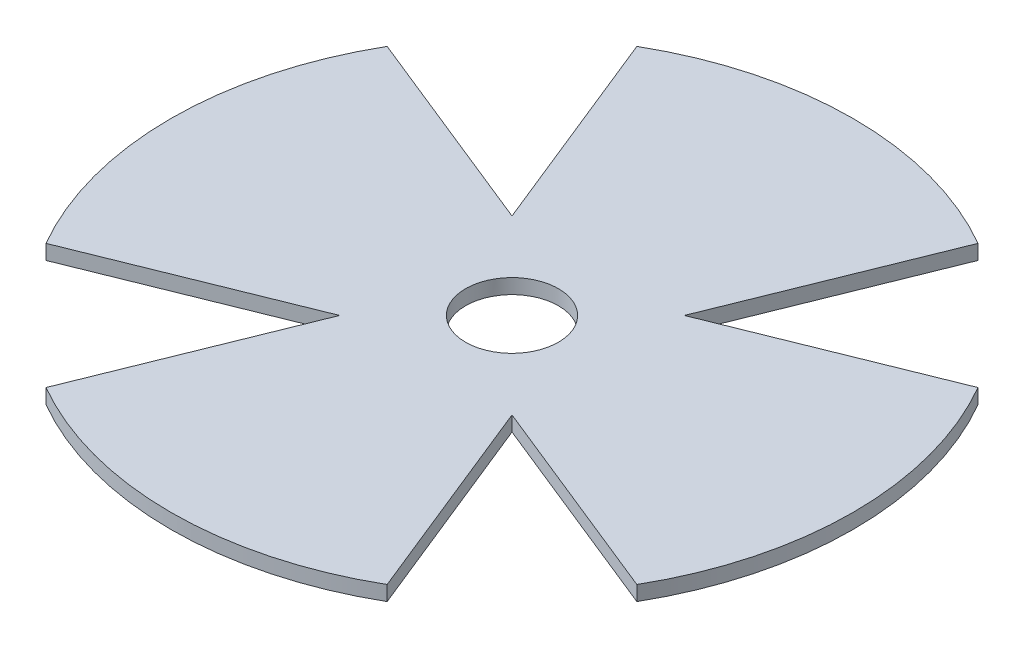
ISO-10303-21;
HEADER;
FILE_DESCRIPTION(('STEP AP214'),'2;1');
FILE_NAME('part.step','',(''),(''),'','','');
FILE_SCHEMA(('AUTOMOTIVE_DESIGN { 1 0 10303 214 1 1 1 1 }'));
ENDSEC;
DATA;
#1=APPLICATION_CONTEXT('core data for automotive mechanical design processes');
#2=APPLICATION_PROTOCOL_DEFINITION('international standard','automotive_design',2000,#1);
#3=PRODUCT_CONTEXT('',#1,'mechanical');
#4=PRODUCT('Part','Part','',(#3));
#5=PRODUCT_RELATED_PRODUCT_CATEGORY('part','',(#4));
#6=PRODUCT_DEFINITION_FORMATION('','',#4);
#7=PRODUCT_DEFINITION_CONTEXT('part definition',#1,'design');
#8=PRODUCT_DEFINITION('design','',#6,#7);
#9=PRODUCT_DEFINITION_SHAPE('','',#8);
#10=(LENGTH_UNIT() NAMED_UNIT(*) SI_UNIT(.MILLI.,.METRE.));
#11=(NAMED_UNIT(*) PLANE_ANGLE_UNIT() SI_UNIT($,.RADIAN.));
#12=(NAMED_UNIT(*) SI_UNIT($,.STERADIAN.) SOLID_ANGLE_UNIT());
#13=UNCERTAINTY_MEASURE_WITH_UNIT(LENGTH_MEASURE(1.E-05),#10,'distance_accuracy_value','');
#14=(GEOMETRIC_REPRESENTATION_CONTEXT(3) GLOBAL_UNCERTAINTY_ASSIGNED_CONTEXT((#13)) GLOBAL_UNIT_ASSIGNED_CONTEXT((#10,
#11,#12)) REPRESENTATION_CONTEXT('',''));
#15=CARTESIAN_POINT('',(0.,0.,0.));
#16=DIRECTION('',(0.,0.,1.));
#17=DIRECTION('',(1.,0.,0.));
#18=AXIS2_PLACEMENT_3D('',#15,#16,#17);
#19=CARTESIAN_POINT('',(0.,1.52,0.));
#20=DIRECTION('',(0.,-1.,0.));
#21=DIRECTION('',(0.,0.,-1.));
#22=AXIS2_PLACEMENT_3D('',#19,#20,#21);
#23=PLANE('',#22);
#24=CARTESIAN_POINT('',(0.,1.52,0.));
#25=DIRECTION('',(0.,1.,0.));
#26=DIRECTION('',(0.,0.,1.));
#27=AXIS2_PLACEMENT_3D('',#24,#25,#26);
#28=CIRCLE('',#27,4.7625);
#29=CARTESIAN_POINT('',(0.,1.52,4.7625));
#30=VERTEX_POINT('',#29);
#31=EDGE_CURVE('E219',#30,#30,#28,.T.);
#32=ORIENTED_EDGE('',*,*,#31,.F.);
#33=EDGE_LOOP('',(#32));
#34=FACE_BOUND('',#33,.T.);
#35=DIRECTION('',(0.374082711400712,0.,0.927395344516615));
#36=VECTOR('',#35,1.);
#37=CARTESIAN_POINT('',(-17.5,1.52,-30.3108891324554));
#38=LINE('',#37,#36);
#39=CARTESIAN_POINT('',(-17.5,1.52,-30.3108891324554));
#40=VERTEX_POINT('',#39);
#41=CARTESIAN_POINT('',(-8.83883476483185,1.52,-8.83883476483184));
#42=VERTEX_POINT('',#41);
#43=EDGE_CURVE('E222',#40,#42,#38,.T.);
#44=ORIENTED_EDGE('',*,*,#43,.T.);
#45=DIRECTION('',(-0.927395344516616,0.,-0.374082711400711));
#46=VECTOR('',#45,1.);
#47=CARTESIAN_POINT('',(-8.83883476483185,1.52,-8.83883476483184));
#48=LINE('',#47,#46);
#49=CARTESIAN_POINT('',(-30.3108891324554,1.52,-17.5));
#50=VERTEX_POINT('',#49);
#51=EDGE_CURVE('E225',#42,#50,#48,.T.);
#52=ORIENTED_EDGE('',*,*,#51,.T.);
#53=CARTESIAN_POINT('',(0.,1.52,0.));
#54=DIRECTION('',(0.,1.,0.));
#55=DIRECTION('',(0.,0.,-1.));
#56=AXIS2_PLACEMENT_3D('',#53,#54,#55);
#57=CIRCLE('',#56,35.);
#58=CARTESIAN_POINT('',(-30.3108891324554,1.52,17.5));
#59=VERTEX_POINT('',#58);
#60=EDGE_CURVE('E157',#50,#59,#57,.T.);
#61=ORIENTED_EDGE('',*,*,#60,.T.);
#62=DIRECTION('',(0.927395344516615,0.,-0.374082711400712));
#63=VECTOR('',#62,1.);
#64=CARTESIAN_POINT('',(-30.3108891324554,1.52,17.5));
#65=LINE('',#64,#63);
#66=CARTESIAN_POINT('',(-8.83883476483184,1.52,8.83883476483185));
#67=VERTEX_POINT('',#66);
#68=EDGE_CURVE('E215',#59,#67,#65,.T.);
#69=ORIENTED_EDGE('',*,*,#68,.T.);
#70=DIRECTION('',(-0.374082711400712,0.,0.927395344516615));
#71=VECTOR('',#70,1.);
#72=CARTESIAN_POINT('',(-8.83883476483184,1.52,8.83883476483185));
#73=LINE('',#72,#71);
#74=CARTESIAN_POINT('',(-17.5,1.52,30.3108891324554));
#75=VERTEX_POINT('',#74);
#76=EDGE_CURVE('E149',#67,#75,#73,.T.);
#77=ORIENTED_EDGE('',*,*,#76,.T.);
#78=CARTESIAN_POINT('',(0.,1.52,0.));
#79=DIRECTION('',(0.,1.,0.));
#80=DIRECTION('',(0.,0.,-1.));
#81=AXIS2_PLACEMENT_3D('',#78,#79,#80);
#82=CIRCLE('',#81,35.);
#83=CARTESIAN_POINT('',(17.5,1.52,30.3108891324554));
#84=VERTEX_POINT('',#83);
#85=EDGE_CURVE('E153',#75,#84,#82,.T.);
#86=ORIENTED_EDGE('',*,*,#85,.T.);
#87=DIRECTION('',(0.374082711400712,0.,0.927395344516615));
#88=VECTOR('',#87,1.);
#89=CARTESIAN_POINT('',(8.83883476483185,1.52,8.83883476483184));
#90=LINE('',#89,#88);
#91=CARTESIAN_POINT('',(8.83883476483185,1.52,8.83883476483184));
#92=VERTEX_POINT('',#91);
#93=EDGE_CURVE('E148',#92,#84,#90,.T.);
#94=ORIENTED_EDGE('',*,*,#93,.F.);
#95=DIRECTION('',(-0.927395344516615,0.,-0.374082711400712));
#96=VECTOR('',#95,1.);
#97=CARTESIAN_POINT('',(30.3108891324554,1.52,17.5));
#98=LINE('',#97,#96);
#99=CARTESIAN_POINT('',(30.3108891324554,1.52,17.5));
#100=VERTEX_POINT('',#99);
#101=EDGE_CURVE('E130',#100,#92,#98,.T.);
#102=ORIENTED_EDGE('',*,*,#101,.F.);
#103=CARTESIAN_POINT('',(0.,1.52,0.));
#104=DIRECTION('',(0.,1.,0.));
#105=DIRECTION('',(0.,0.,-1.));
#106=AXIS2_PLACEMENT_3D('',#103,#104,#105);
#107=CIRCLE('',#106,35.);
#108=CARTESIAN_POINT('',(30.3108891324554,1.52,-17.5));
#109=VERTEX_POINT('',#108);
#110=EDGE_CURVE('E145',#100,#109,#107,.T.);
#111=ORIENTED_EDGE('',*,*,#110,.T.);
#112=DIRECTION('',(0.927395344516615,0.,-0.374082711400712));
#113=VECTOR('',#112,1.);
#114=CARTESIAN_POINT('',(8.83883476483184,1.52,-8.83883476483185));
#115=LINE('',#114,#113);
#116=CARTESIAN_POINT('',(8.83883476483184,1.52,-8.83883476483185));
#117=VERTEX_POINT('',#116);
#118=EDGE_CURVE('E232',#117,#109,#115,.T.);
#119=ORIENTED_EDGE('',*,*,#118,.F.);
#120=DIRECTION('',(-0.374082711400712,0.,0.927395344516615));
#121=VECTOR('',#120,1.);
#122=CARTESIAN_POINT('',(17.5,1.52,-30.3108891324554));
#123=LINE('',#122,#121);
#124=CARTESIAN_POINT('',(17.5,1.52,-30.3108891324554));
#125=VERTEX_POINT('',#124);
#126=EDGE_CURVE('E228',#125,#117,#123,.T.);
#127=ORIENTED_EDGE('',*,*,#126,.F.);
#128=CARTESIAN_POINT('',(0.,1.52,0.));
#129=DIRECTION('',(0.,1.,0.));
#130=DIRECTION('',(0.,0.,-1.));
#131=AXIS2_PLACEMENT_3D('',#128,#129,#130);
#132=CIRCLE('',#131,35.);
#133=EDGE_CURVE('E171',#125,#40,#132,.T.);
#134=ORIENTED_EDGE('',*,*,#133,.T.);
#135=EDGE_LOOP('',(#44,#52,#61,#69,#77,#86,#94,#102,#111,#119,#127,#134));
#136=FACE_BOUND('',#135,.T.);
#137=ADVANCED_FACE('F36',(#34,#136),#23,.F.);
#138=CARTESIAN_POINT('',(0.,0.,0.));
#139=DIRECTION('',(0.,-1.,0.));
#140=DIRECTION('',(0.,0.,-1.));
#141=AXIS2_PLACEMENT_3D('',#138,#139,#140);
#142=PLANE('',#141);
#143=CARTESIAN_POINT('',(0.,0.,0.));
#144=DIRECTION('',(0.,-1.,0.));
#145=DIRECTION('',(0.,0.,-1.));
#146=AXIS2_PLACEMENT_3D('',#143,#144,#145);
#147=CIRCLE('',#146,4.7625);
#148=CARTESIAN_POINT('',(0.,0.,-4.7625));
#149=VERTEX_POINT('',#148);
#150=EDGE_CURVE('E40',#149,#149,#147,.T.);
#151=ORIENTED_EDGE('',*,*,#150,.F.);
#152=EDGE_LOOP('',(#151));
#153=FACE_BOUND('',#152,.T.);
#154=DIRECTION('',(0.927395344516616,0.,0.374082711400711));
#155=VECTOR('',#154,1.);
#156=CARTESIAN_POINT('',(1.82950347418654,0.,-4.53555578226155));
#157=LINE('',#156,#155);
#158=CARTESIAN_POINT('',(-30.3108891324554,0.,-17.5));
#159=VERTEX_POINT('',#158);
#160=CARTESIAN_POINT('',(-8.83883476483185,0.,-8.83883476483184));
#161=VERTEX_POINT('',#160);
#162=EDGE_CURVE('E45',#159,#161,#157,.T.);
#163=ORIENTED_EDGE('',*,*,#162,.T.);
#164=DIRECTION('',(-0.374082711400712,0.,-0.927395344516615));
#165=VECTOR('',#164,1.);
#166=CARTESIAN_POINT('',(-4.53555578226155,0.,1.82950347418655));
#167=LINE('',#166,#165);
#168=CARTESIAN_POINT('',(-17.5,0.,-30.3108891324554));
#169=VERTEX_POINT('',#168);
#170=EDGE_CURVE('E11',#161,#169,#167,.T.);
#171=ORIENTED_EDGE('',*,*,#170,.T.);
#172=CARTESIAN_POINT('',(0.,0.,0.));
#173=DIRECTION('',(0.,1.,0.));
#174=DIRECTION('',(0.,0.,-1.));
#175=AXIS2_PLACEMENT_3D('',#172,#173,#174);
#176=CIRCLE('',#175,35.);
#177=CARTESIAN_POINT('',(17.5,0.,-30.3108891324554));
#178=VERTEX_POINT('',#177);
#179=EDGE_CURVE('E161',#178,#169,#176,.T.);
#180=ORIENTED_EDGE('',*,*,#179,.F.);
#181=DIRECTION('',(0.374082711400712,0.,-0.927395344516615));
#182=VECTOR('',#181,1.);
#183=CARTESIAN_POINT('',(4.53555578226154,0.,1.82950347418654));
#184=LINE('',#183,#182);
#185=CARTESIAN_POINT('',(8.83883476483184,0.,-8.83883476483185));
#186=VERTEX_POINT('',#185);
#187=EDGE_CURVE('E196',#186,#178,#184,.T.);
#188=ORIENTED_EDGE('',*,*,#187,.F.);
#189=DIRECTION('',(-0.927395344516615,0.,0.374082711400712));
#190=VECTOR('',#189,1.);
#191=CARTESIAN_POINT('',(-1.82950347418655,0.,-4.53555578226155));
#192=LINE('',#191,#190);
#193=CARTESIAN_POINT('',(30.3108891324554,0.,-17.5));
#194=VERTEX_POINT('',#193);
#195=EDGE_CURVE('E194',#194,#186,#192,.T.);
#196=ORIENTED_EDGE('',*,*,#195,.F.);
#197=CARTESIAN_POINT('',(0.,0.,0.));
#198=DIRECTION('',(0.,1.,0.));
#199=DIRECTION('',(0.,0.,-1.));
#200=AXIS2_PLACEMENT_3D('',#197,#198,#199);
#201=CIRCLE('',#200,35.);
#202=CARTESIAN_POINT('',(30.3108891324554,0.,17.5));
#203=VERTEX_POINT('',#202);
#204=EDGE_CURVE('E170',#203,#194,#201,.T.);
#205=ORIENTED_EDGE('',*,*,#204,.F.);
#206=DIRECTION('',(0.927395344516615,0.,0.374082711400712));
#207=VECTOR('',#206,1.);
#208=CARTESIAN_POINT('',(-1.82950347418654,0.,4.53555578226154));
#209=LINE('',#208,#207);
#210=CARTESIAN_POINT('',(8.83883476483185,0.,8.83883476483184));
#211=VERTEX_POINT('',#210);
#212=EDGE_CURVE('E133',#211,#203,#209,.T.);
#213=ORIENTED_EDGE('',*,*,#212,.F.);
#214=DIRECTION('',(-0.374082711400712,0.,-0.927395344516615));
#215=VECTOR('',#214,1.);
#216=CARTESIAN_POINT('',(4.53555578226155,0.,-1.82950347418655));
#217=LINE('',#216,#215);
#218=CARTESIAN_POINT('',(17.5,0.,30.3108891324554));
#219=VERTEX_POINT('',#218);
#220=EDGE_CURVE('E191',#219,#211,#217,.T.);
#221=ORIENTED_EDGE('',*,*,#220,.F.);
#222=CARTESIAN_POINT('',(0.,0.,0.));
#223=DIRECTION('',(0.,1.,0.));
#224=DIRECTION('',(0.,0.,-1.));
#225=AXIS2_PLACEMENT_3D('',#222,#223,#224);
#226=CIRCLE('',#225,35.);
#227=CARTESIAN_POINT('',(-17.5,0.,30.3108891324554));
#228=VERTEX_POINT('',#227);
#229=EDGE_CURVE('E167',#228,#219,#226,.T.);
#230=ORIENTED_EDGE('',*,*,#229,.F.);
#231=DIRECTION('',(0.374082711400712,0.,-0.927395344516616));
#232=VECTOR('',#231,1.);
#233=CARTESIAN_POINT('',(-4.53555578226154,0.,-1.82950347418654));
#234=LINE('',#233,#232);
#235=CARTESIAN_POINT('',(-8.83883476483184,0.,8.83883476483185));
#236=VERTEX_POINT('',#235);
#237=EDGE_CURVE('E185',#228,#236,#234,.T.);
#238=ORIENTED_EDGE('',*,*,#237,.T.);
#239=DIRECTION('',(-0.927395344516615,0.,0.374082711400712));
#240=VECTOR('',#239,1.);
#241=CARTESIAN_POINT('',(1.82950347418655,0.,4.53555578226155));
#242=LINE('',#241,#240);
#243=CARTESIAN_POINT('',(-30.3108891324554,0.,17.5));
#244=VERTEX_POINT('',#243);
#245=EDGE_CURVE('E188',#236,#244,#242,.T.);
#246=ORIENTED_EDGE('',*,*,#245,.T.);
#247=CARTESIAN_POINT('',(0.,0.,0.));
#248=DIRECTION('',(0.,1.,0.));
#249=DIRECTION('',(0.,0.,-1.));
#250=AXIS2_PLACEMENT_3D('',#247,#248,#249);
#251=CIRCLE('',#250,35.);
#252=EDGE_CURVE('E164',#159,#244,#251,.T.);
#253=ORIENTED_EDGE('',*,*,#252,.F.);
#254=EDGE_LOOP('',(#163,#171,#180,#188,#196,#205,#213,#221,#230,#238,#246,#253));
#255=FACE_BOUND('',#254,.T.);
#256=ADVANCED_FACE('F201',(#153,#255),#142,.T.);
#257=CARTESIAN_POINT('',(0.,1.52,0.));
#258=DIRECTION('',(0.,-1.,0.));
#259=DIRECTION('',(0.,0.,-1.));
#260=AXIS2_PLACEMENT_3D('',#257,#258,#259);
#261=CYLINDRICAL_SURFACE('',#260,35.);
#262=ORIENTED_EDGE('',*,*,#179,.T.);
#263=DIRECTION('',(0.,-1.,0.));
#264=VECTOR('',#263,1.);
#265=CARTESIAN_POINT('',(-17.5,1.52,-30.3108891324554));
#266=LINE('',#265,#264);
#267=EDGE_CURVE('E183',#40,#169,#266,.T.);
#268=ORIENTED_EDGE('',*,*,#267,.F.);
#269=ORIENTED_EDGE('',*,*,#133,.F.);
#270=DIRECTION('',(0.,-1.,0.));
#271=VECTOR('',#270,1.);
#272=CARTESIAN_POINT('',(17.5,1.52,-30.3108891324554));
#273=LINE('',#272,#271);
#274=EDGE_CURVE('E152',#125,#178,#273,.T.);
#275=ORIENTED_EDGE('',*,*,#274,.T.);
#276=EDGE_LOOP('',(#262,#268,#269,#275));
#277=FACE_BOUND('',#276,.T.);
#278=ADVANCED_FACE('F38',(#277),#261,.T.);
#279=CARTESIAN_POINT('',(0.,1.52,0.));
#280=DIRECTION('',(0.,-1.,0.));
#281=DIRECTION('',(0.,0.,-1.));
#282=AXIS2_PLACEMENT_3D('',#279,#280,#281);
#283=CYLINDRICAL_SURFACE('',#282,35.);
#284=ORIENTED_EDGE('',*,*,#252,.T.);
#285=DIRECTION('',(0.,-1.,0.));
#286=VECTOR('',#285,1.);
#287=CARTESIAN_POINT('',(-30.3108891324554,1.52,17.5));
#288=LINE('',#287,#286);
#289=EDGE_CURVE('E178',#59,#244,#288,.T.);
#290=ORIENTED_EDGE('',*,*,#289,.F.);
#291=ORIENTED_EDGE('',*,*,#60,.F.);
#292=DIRECTION('',(0.,-1.,0.));
#293=VECTOR('',#292,1.);
#294=CARTESIAN_POINT('',(-30.3108891324554,1.52,-17.5));
#295=LINE('',#294,#293);
#296=EDGE_CURVE('E180',#50,#159,#295,.T.);
#297=ORIENTED_EDGE('',*,*,#296,.T.);
#298=EDGE_LOOP('',(#284,#290,#291,#297));
#299=FACE_BOUND('',#298,.T.);
#300=ADVANCED_FACE('F207',(#299),#283,.T.);
#301=CARTESIAN_POINT('',(0.,1.52,0.));
#302=DIRECTION('',(0.,-1.,0.));
#303=DIRECTION('',(0.,0.,-1.));
#304=AXIS2_PLACEMENT_3D('',#301,#302,#303);
#305=CYLINDRICAL_SURFACE('',#304,35.);
#306=ORIENTED_EDGE('',*,*,#229,.T.);
#307=DIRECTION('',(0.,-1.,0.));
#308=VECTOR('',#307,1.);
#309=CARTESIAN_POINT('',(17.5,1.52,30.3108891324554));
#310=LINE('',#309,#308);
#311=EDGE_CURVE('E138',#84,#219,#310,.T.);
#312=ORIENTED_EDGE('',*,*,#311,.F.);
#313=ORIENTED_EDGE('',*,*,#85,.F.);
#314=DIRECTION('',(0.,-1.,0.));
#315=VECTOR('',#314,1.);
#316=CARTESIAN_POINT('',(-17.5,1.52,30.3108891324554));
#317=LINE('',#316,#315);
#318=EDGE_CURVE('E175',#75,#228,#317,.T.);
#319=ORIENTED_EDGE('',*,*,#318,.T.);
#320=EDGE_LOOP('',(#306,#312,#313,#319));
#321=FACE_BOUND('',#320,.T.);
#322=ADVANCED_FACE('F278',(#321),#305,.T.);
#323=CARTESIAN_POINT('',(0.,1.52,0.));
#324=DIRECTION('',(0.,-1.,0.));
#325=DIRECTION('',(0.,0.,-1.));
#326=AXIS2_PLACEMENT_3D('',#323,#324,#325);
#327=CYLINDRICAL_SURFACE('',#326,35.);
#328=ORIENTED_EDGE('',*,*,#204,.T.);
#329=DIRECTION('',(0.,-1.,0.));
#330=VECTOR('',#329,1.);
#331=CARTESIAN_POINT('',(30.3108891324554,1.52,-17.5));
#332=LINE('',#331,#330);
#333=EDGE_CURVE('E139',#109,#194,#332,.T.);
#334=ORIENTED_EDGE('',*,*,#333,.F.);
#335=ORIENTED_EDGE('',*,*,#110,.F.);
#336=DIRECTION('',(0.,-1.,0.));
#337=VECTOR('',#336,1.);
#338=CARTESIAN_POINT('',(30.3108891324554,1.52,17.5));
#339=LINE('',#338,#337);
#340=EDGE_CURVE('E126',#100,#203,#339,.T.);
#341=ORIENTED_EDGE('',*,*,#340,.T.);
#342=EDGE_LOOP('',(#328,#334,#335,#341));
#343=FACE_BOUND('',#342,.T.);
#344=ADVANCED_FACE('F151',(#343),#327,.T.);
#345=CARTESIAN_POINT('',(-30.3108891324554,-1.2E-05,17.5));
#346=DIRECTION('',(0.374082711400712,0.,0.927395344516615));
#347=DIRECTION('',(0.927395344516615,0.,-0.374082711400712));
#348=AXIS2_PLACEMENT_3D('',#345,#346,#347);
#349=PLANE('',#348);
#350=DIRECTION('',(0.,1.,0.));
#351=VECTOR('',#350,1.);
#352=CARTESIAN_POINT('',(-8.83883476483184,-1.2E-05,8.83883476483185));
#353=LINE('',#352,#351);
#354=EDGE_CURVE('E60',#236,#67,#353,.T.);
#355=ORIENTED_EDGE('',*,*,#354,.T.);
#356=ORIENTED_EDGE('',*,*,#68,.F.);
#357=ORIENTED_EDGE('',*,*,#289,.T.);
#358=ORIENTED_EDGE('',*,*,#245,.F.);
#359=EDGE_LOOP('',(#355,#356,#357,#358));
#360=FACE_BOUND('',#359,.T.);
#361=ADVANCED_FACE('F277',(#360),#349,.T.);
#362=CARTESIAN_POINT('',(-8.83883476483184,-1.2E-05,8.83883476483185));
#363=DIRECTION('',(-0.927395344516615,0.,-0.374082711400712));
#364=DIRECTION('',(-0.374082711400712,0.,0.927395344516616));
#365=AXIS2_PLACEMENT_3D('',#362,#363,#364);
#366=PLANE('',#365);
#367=ORIENTED_EDGE('',*,*,#318,.F.);
#368=ORIENTED_EDGE('',*,*,#76,.F.);
#369=ORIENTED_EDGE('',*,*,#354,.F.);
#370=ORIENTED_EDGE('',*,*,#237,.F.);
#371=EDGE_LOOP('',(#367,#368,#369,#370));
#372=FACE_BOUND('',#371,.T.);
#373=ADVANCED_FACE('F272',(#372),#366,.T.);
#374=CARTESIAN_POINT('',(30.3108891324554,-1.2E-05,17.5));
#375=DIRECTION('',(0.374082711400712,0.,-0.927395344516615));
#376=DIRECTION('',(-0.927395344516615,0.,-0.374082711400712));
#377=AXIS2_PLACEMENT_3D('',#374,#375,#376);
#378=PLANE('',#377);
#379=ORIENTED_EDGE('',*,*,#212,.T.);
#380=ORIENTED_EDGE('',*,*,#340,.F.);
#381=ORIENTED_EDGE('',*,*,#101,.T.);
#382=DIRECTION('',(0.,1.,0.));
#383=VECTOR('',#382,1.);
#384=CARTESIAN_POINT('',(8.83883476483185,-1.2E-05,8.83883476483184));
#385=LINE('',#384,#383);
#386=EDGE_CURVE('E231',#211,#92,#385,.T.);
#387=ORIENTED_EDGE('',*,*,#386,.F.);
#388=EDGE_LOOP('',(#379,#380,#381,#387));
#389=FACE_BOUND('',#388,.T.);
#390=ADVANCED_FACE('F128',(#389),#378,.F.);
#391=CARTESIAN_POINT('',(8.83883476483185,-1.2E-05,8.83883476483184));
#392=DIRECTION('',(-0.927395344516615,0.,0.374082711400712));
#393=DIRECTION('',(0.374082711400712,0.,0.927395344516615));
#394=AXIS2_PLACEMENT_3D('',#391,#392,#393);
#395=PLANE('',#394);
#396=ORIENTED_EDGE('',*,*,#220,.T.);
#397=ORIENTED_EDGE('',*,*,#386,.T.);
#398=ORIENTED_EDGE('',*,*,#93,.T.);
#399=ORIENTED_EDGE('',*,*,#311,.T.);
#400=EDGE_LOOP('',(#396,#397,#398,#399));
#401=FACE_BOUND('',#400,.T.);
#402=ADVANCED_FACE('F237',(#401),#395,.F.);
#403=CARTESIAN_POINT('',(17.5,-1.2E-05,-30.3108891324554));
#404=DIRECTION('',(-0.927395344516615,0.,-0.374082711400712));
#405=DIRECTION('',(-0.374082711400712,0.,0.927395344516615));
#406=AXIS2_PLACEMENT_3D('',#403,#404,#405);
#407=PLANE('',#406);
#408=ORIENTED_EDGE('',*,*,#187,.T.);
#409=ORIENTED_EDGE('',*,*,#274,.F.);
#410=ORIENTED_EDGE('',*,*,#126,.T.);
#411=DIRECTION('',(0.,1.,0.));
#412=VECTOR('',#411,1.);
#413=CARTESIAN_POINT('',(8.83883476483184,-1.2E-05,-8.83883476483185));
#414=LINE('',#413,#412);
#415=EDGE_CURVE('E224',#186,#117,#414,.T.);
#416=ORIENTED_EDGE('',*,*,#415,.F.);
#417=EDGE_LOOP('',(#408,#409,#410,#416));
#418=FACE_BOUND('',#417,.T.);
#419=ADVANCED_FACE('F246',(#418),#407,.F.);
#420=CARTESIAN_POINT('',(8.83883476483184,-1.2E-05,-8.83883476483185));
#421=DIRECTION('',(0.374082711400712,0.,0.927395344516615));
#422=DIRECTION('',(0.927395344516615,0.,-0.374082711400712));
#423=AXIS2_PLACEMENT_3D('',#420,#421,#422);
#424=PLANE('',#423);
#425=ORIENTED_EDGE('',*,*,#195,.T.);
#426=ORIENTED_EDGE('',*,*,#415,.T.);
#427=ORIENTED_EDGE('',*,*,#118,.T.);
#428=ORIENTED_EDGE('',*,*,#333,.T.);
#429=EDGE_LOOP('',(#425,#426,#427,#428));
#430=FACE_BOUND('',#429,.T.);
#431=ADVANCED_FACE('F244',(#430),#424,.F.);
#432=CARTESIAN_POINT('',(-17.5,-1.2E-05,-30.3108891324554));
#433=DIRECTION('',(-0.927395344516615,0.,0.374082711400712));
#434=DIRECTION('',(0.374082711400712,0.,0.927395344516615));
#435=AXIS2_PLACEMENT_3D('',#432,#433,#434);
#436=PLANE('',#435);
#437=DIRECTION('',(0.,1.,0.));
#438=VECTOR('',#437,1.);
#439=CARTESIAN_POINT('',(-8.83883476483185,-1.2E-05,-8.83883476483184));
#440=LINE('',#439,#438);
#441=EDGE_CURVE('E52',#161,#42,#440,.T.);
#442=ORIENTED_EDGE('',*,*,#441,.T.);
#443=ORIENTED_EDGE('',*,*,#43,.F.);
#444=ORIENTED_EDGE('',*,*,#267,.T.);
#445=ORIENTED_EDGE('',*,*,#170,.F.);
#446=EDGE_LOOP('',(#442,#443,#444,#445));
#447=FACE_BOUND('',#446,.T.);
#448=ADVANCED_FACE('F252',(#447),#436,.T.);
#449=CARTESIAN_POINT('',(-8.83883476483185,-1.2E-05,-8.83883476483184));
#450=DIRECTION('',(0.374082711400711,0.,-0.927395344516616));
#451=DIRECTION('',(-0.927395344516616,0.,-0.374082711400711));
#452=AXIS2_PLACEMENT_3D('',#449,#450,#451);
#453=PLANE('',#452);
#454=ORIENTED_EDGE('',*,*,#296,.F.);
#455=ORIENTED_EDGE('',*,*,#51,.F.);
#456=ORIENTED_EDGE('',*,*,#441,.F.);
#457=ORIENTED_EDGE('',*,*,#162,.F.);
#458=EDGE_LOOP('',(#454,#455,#456,#457));
#459=FACE_BOUND('',#458,.T.);
#460=ADVANCED_FACE('F203',(#459),#453,.T.);
#461=CARTESIAN_POINT('',(0.,-1.2E-05,0.));
#462=DIRECTION('',(0.,1.,0.));
#463=DIRECTION('',(0.,0.,1.));
#464=AXIS2_PLACEMENT_3D('',#461,#462,#463);
#465=CYLINDRICAL_SURFACE('',#464,4.7625);
#466=ORIENTED_EDGE('',*,*,#150,.T.);
#467=EDGE_LOOP('',(#466));
#468=FACE_BOUND('',#467,.T.);
#469=ORIENTED_EDGE('',*,*,#31,.T.);
#470=EDGE_LOOP('',(#469));
#471=FACE_BOUND('',#470,.T.);
#472=ADVANCED_FACE('F259',(#468,#471),#465,.F.);
#473=CLOSED_SHELL('',(#137,#256,#278,#300,#322,#344,#361,#373,#390,#402,#419,#431,#448,#460,#472));
#474=MANIFOLD_SOLID_BREP('B2',#473);
#475=ADVANCED_BREP_SHAPE_REPRESENTATION('',(#18,#474),#14);
#476=SHAPE_DEFINITION_REPRESENTATION(#9,#475);
ENDSEC;
END-ISO-10303-21;
